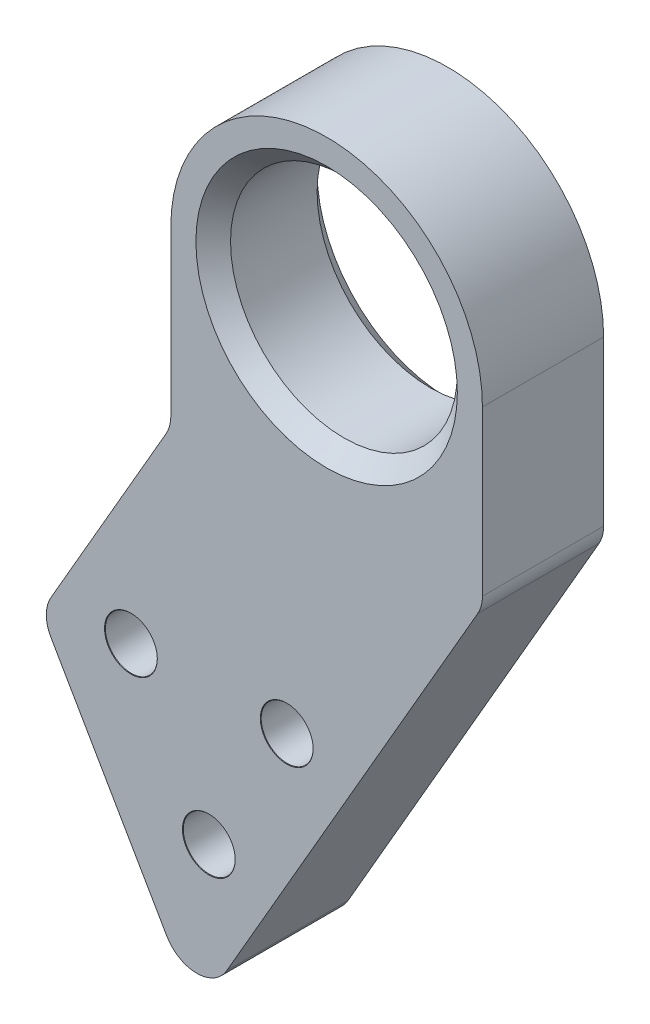
ISO-10303-21;
HEADER;
FILE_DESCRIPTION(('STEP AP214'),'2;1');
FILE_NAME('part.step','',(''),(''),'','','');
FILE_SCHEMA(('AUTOMOTIVE_DESIGN { 1 0 10303 214 1 1 1 1 }'));
ENDSEC;
DATA;
#1=APPLICATION_CONTEXT('core data for automotive mechanical design processes');
#2=APPLICATION_PROTOCOL_DEFINITION('international standard','automotive_design',2000,#1);
#3=PRODUCT_CONTEXT('',#1,'mechanical');
#4=PRODUCT('Part','Part','',(#3));
#5=PRODUCT_RELATED_PRODUCT_CATEGORY('part','',(#4));
#6=PRODUCT_DEFINITION_FORMATION('','',#4);
#7=PRODUCT_DEFINITION_CONTEXT('part definition',#1,'design');
#8=PRODUCT_DEFINITION('design','',#6,#7);
#9=PRODUCT_DEFINITION_SHAPE('','',#8);
#10=(LENGTH_UNIT() NAMED_UNIT(*) SI_UNIT(.MILLI.,.METRE.));
#11=(NAMED_UNIT(*) PLANE_ANGLE_UNIT() SI_UNIT($,.RADIAN.));
#12=(NAMED_UNIT(*) SI_UNIT($,.STERADIAN.) SOLID_ANGLE_UNIT());
#13=UNCERTAINTY_MEASURE_WITH_UNIT(LENGTH_MEASURE(1.E-05),#10,'distance_accuracy_value','');
#14=(GEOMETRIC_REPRESENTATION_CONTEXT(3) GLOBAL_UNCERTAINTY_ASSIGNED_CONTEXT((#13)) GLOBAL_UNIT_ASSIGNED_CONTEXT((#10,
#11,#12)) REPRESENTATION_CONTEXT('',''));
#15=CARTESIAN_POINT('',(0.,0.,0.));
#16=DIRECTION('',(0.,0.,1.));
#17=DIRECTION('',(1.,0.,0.));
#18=AXIS2_PLACEMENT_3D('',#15,#16,#17);
#19=CARTESIAN_POINT('',(0.,0.,7.));
#20=DIRECTION('',(0.,0.,-1.));
#21=DIRECTION('',(-1.,0.,0.));
#22=AXIS2_PLACEMENT_3D('',#19,#20,#21);
#23=PLANE('',#22);
#24=CARTESIAN_POINT('',(-11.3038475772934,-21.9903810567666,7.));
#25=DIRECTION('',(0.,0.,1.));
#26=DIRECTION('',(1.,0.,0.));
#27=AXIS2_PLACEMENT_3D('',#24,#25,#26);
#28=CIRCLE('',#27,1.525);
#29=CARTESIAN_POINT('',(-9.77884757729337,-21.9903810567666,7.));
#30=VERTEX_POINT('',#29);
#31=EDGE_CURVE('E523',#30,#30,#28,.T.);
#32=ORIENTED_EDGE('',*,*,#31,.F.);
#33=EDGE_LOOP('',(#32));
#34=FACE_BOUND('',#33,.T.);
#35=CARTESIAN_POINT('',(-6.80384757729337,-29.7846096908265,7.));
#36=DIRECTION('',(0.,0.,1.));
#37=DIRECTION('',(1.,0.,0.));
#38=AXIS2_PLACEMENT_3D('',#35,#36,#37);
#39=CIRCLE('',#38,1.525);
#40=CARTESIAN_POINT('',(-5.27884757729337,-29.7846096908265,7.));
#41=VERTEX_POINT('',#40);
#42=EDGE_CURVE('E533',#41,#41,#39,.T.);
#43=ORIENTED_EDGE('',*,*,#42,.F.);
#44=EDGE_LOOP('',(#43));
#45=FACE_BOUND('',#44,.T.);
#46=CARTESIAN_POINT('',(-2.30384757729337,-21.9903810567666,7.));
#47=DIRECTION('',(0.,0.,1.));
#48=DIRECTION('',(1.,0.,0.));
#49=AXIS2_PLACEMENT_3D('',#46,#47,#48);
#50=CIRCLE('',#49,1.525);
#51=CARTESIAN_POINT('',(-0.778847577293372,-21.9903810567666,7.));
#52=VERTEX_POINT('',#51);
#53=EDGE_CURVE('E545',#52,#52,#50,.T.);
#54=ORIENTED_EDGE('',*,*,#53,.F.);
#55=EDGE_LOOP('',(#54));
#56=FACE_BOUND('',#55,.T.);
#57=CARTESIAN_POINT('',(0.,0.,7.));
#58=DIRECTION('',(0.,0.,-1.));
#59=DIRECTION('',(-1.,0.,0.));
#60=AXIS2_PLACEMENT_3D('',#57,#58,#59);
#61=CIRCLE('',#60,7.54999999999999);
#62=CARTESIAN_POINT('',(-7.54999999999999,0.,7.));
#63=VERTEX_POINT('',#62);
#64=EDGE_CURVE('E170',#63,#63,#61,.T.);
#65=ORIENTED_EDGE('',*,*,#64,.T.);
#66=EDGE_LOOP('',(#65));
#67=FACE_BOUND('',#66,.T.);
#68=DIRECTION('',(0.500000000000001,0.866025403784438,0.));
#69=VECTOR('',#68,1.);
#70=CARTESIAN_POINT('',(-7.50000000000006,-38.5788383248865,7.));
#71=LINE('',#70,#69);
#72=CARTESIAN_POINT('',(-5.76794919243117,-35.5788383248865,7.));
#73=VERTEX_POINT('',#72);
#74=CARTESIAN_POINT('',(8.73205080756887,-10.4641016151378,7.));
#75=VERTEX_POINT('',#74);
#76=EDGE_CURVE('E237',#73,#75,#71,.T.);
#77=ORIENTED_EDGE('',*,*,#76,.T.);
#78=CARTESIAN_POINT('',(7.,-9.46410161513776,7.));
#79=DIRECTION('',(0.,0.,-1.));
#80=DIRECTION('',(-1.,0.,0.));
#81=AXIS2_PLACEMENT_3D('',#78,#79,#80);
#82=CIRCLE('',#81,2.);
#83=CARTESIAN_POINT('',(9.,-9.46410161513776,7.));
#84=VERTEX_POINT('',#83);
#85=EDGE_CURVE('E208',#75,#84,#82,.F.);
#86=ORIENTED_EDGE('',*,*,#85,.T.);
#87=DIRECTION('',(0.,1.,0.));
#88=VECTOR('',#87,1.);
#89=CARTESIAN_POINT('',(9.,-10.,7.));
#90=LINE('',#89,#88);
#91=CARTESIAN_POINT('',(9.,0.,7.));
#92=VERTEX_POINT('',#91);
#93=EDGE_CURVE('E141',#84,#92,#90,.T.);
#94=ORIENTED_EDGE('',*,*,#93,.T.);
#95=CARTESIAN_POINT('',(0.,0.,7.));
#96=DIRECTION('',(0.,0.,1.));
#97=DIRECTION('',(-1.,0.,0.));
#98=AXIS2_PLACEMENT_3D('',#95,#96,#97);
#99=CIRCLE('',#98,9.);
#100=CARTESIAN_POINT('',(-9.,0.,7.));
#101=VERTEX_POINT('',#100);
#102=EDGE_CURVE('E136',#92,#101,#99,.T.);
#103=ORIENTED_EDGE('',*,*,#102,.T.);
#104=DIRECTION('',(0.,-1.,0.));
#105=VECTOR('',#104,1.);
#106=CARTESIAN_POINT('',(-9.,0.,7.));
#107=LINE('',#106,#105);
#108=CARTESIAN_POINT('',(-9.,-9.46410161513775,7.));
#109=VERTEX_POINT('',#108);
#110=EDGE_CURVE('E124',#101,#109,#107,.T.);
#111=ORIENTED_EDGE('',*,*,#110,.T.);
#112=CARTESIAN_POINT('',(-11.,-9.46410161513775,7.));
#113=DIRECTION('',(0.,0.,-1.));
#114=DIRECTION('',(-1.,0.,0.));
#115=AXIS2_PLACEMENT_3D('',#112,#113,#114);
#116=CIRCLE('',#115,2.);
#117=CARTESIAN_POINT('',(-9.26794919243112,-10.4641016151378,7.));
#118=VERTEX_POINT('',#117);
#119=EDGE_CURVE('E11',#109,#118,#116,.T.);
#120=ORIENTED_EDGE('',*,*,#119,.T.);
#121=DIRECTION('',(-0.500000000000001,-0.866025403784438,0.));
#122=VECTOR('',#121,1.);
#123=CARTESIAN_POINT('',(-9.,-10.,7.));
#124=LINE('',#123,#122);
#125=CARTESIAN_POINT('',(-15.9226497308104,-21.9903810567666,7.));
#126=VERTEX_POINT('',#125);
#127=EDGE_CURVE('E135',#118,#126,#124,.T.);
#128=ORIENTED_EDGE('',*,*,#127,.T.);
#129=CARTESIAN_POINT('',(-14.1905989232415,-22.9903810567666,7.));
#130=DIRECTION('',(0.,0.,-1.));
#131=DIRECTION('',(-1.,0.,0.));
#132=AXIS2_PLACEMENT_3D('',#129,#130,#131);
#133=CIRCLE('',#132,2.);
#134=CARTESIAN_POINT('',(-15.9226497308104,-23.9903810567666,7.));
#135=VERTEX_POINT('',#134);
#136=EDGE_CURVE('E68',#126,#135,#133,.F.);
#137=ORIENTED_EDGE('',*,*,#136,.T.);
#138=DIRECTION('',(0.499999999999998,-0.86602540378444,0.));
#139=VECTOR('',#138,1.);
#140=CARTESIAN_POINT('',(-16.5,-22.9903810567666,7.));
#141=LINE('',#140,#139);
#142=CARTESIAN_POINT('',(-9.23205080756893,-35.5788383248865,7.));
#143=VERTEX_POINT('',#142);
#144=EDGE_CURVE('E234',#135,#143,#141,.T.);
#145=ORIENTED_EDGE('',*,*,#144,.T.);
#146=CARTESIAN_POINT('',(-7.50000000000005,-34.5788383248865,7.));
#147=DIRECTION('',(0.,0.,-1.));
#148=DIRECTION('',(-1.,0.,0.));
#149=AXIS2_PLACEMENT_3D('',#146,#147,#148);
#150=CIRCLE('',#149,2.);
#151=EDGE_CURVE('E205',#143,#73,#150,.F.);
#152=ORIENTED_EDGE('',*,*,#151,.T.);
#153=EDGE_LOOP('',(#77,#86,#94,#103,#111,#120,#128,#137,#145,#152));
#154=FACE_BOUND('',#153,.T.);
#155=ADVANCED_FACE('F45',(#34,#45,#56,#67,#154),#23,.F.);
#156=CARTESIAN_POINT('',(0.,0.,0.));
#157=DIRECTION('',(0.,0.,-1.));
#158=DIRECTION('',(-1.,0.,0.));
#159=AXIS2_PLACEMENT_3D('',#156,#157,#158);
#160=PLANE('',#159);
#161=CARTESIAN_POINT('',(-11.3038475772934,-21.9903810567666,0.));
#162=DIRECTION('',(0.,0.,1.));
#163=DIRECTION('',(1.,0.,0.));
#164=AXIS2_PLACEMENT_3D('',#161,#162,#163);
#165=CIRCLE('',#164,1.5);
#166=CARTESIAN_POINT('',(-9.80384757729337,-21.9903810567666,0.));
#167=VERTEX_POINT('',#166);
#168=EDGE_CURVE('E527',#167,#167,#165,.T.);
#169=ORIENTED_EDGE('',*,*,#168,.T.);
#170=EDGE_LOOP('',(#169));
#171=FACE_BOUND('',#170,.T.);
#172=CARTESIAN_POINT('',(-6.80384757729337,-29.7846096908265,0.));
#173=DIRECTION('',(0.,0.,1.));
#174=DIRECTION('',(1.,0.,0.));
#175=AXIS2_PLACEMENT_3D('',#172,#173,#174);
#176=CIRCLE('',#175,1.5);
#177=CARTESIAN_POINT('',(-5.30384757729337,-29.7846096908265,0.));
#178=VERTEX_POINT('',#177);
#179=EDGE_CURVE('E541',#178,#178,#176,.T.);
#180=ORIENTED_EDGE('',*,*,#179,.T.);
#181=EDGE_LOOP('',(#180));
#182=FACE_BOUND('',#181,.T.);
#183=CARTESIAN_POINT('',(-2.30384757729337,-21.9903810567666,0.));
#184=DIRECTION('',(0.,0.,1.));
#185=DIRECTION('',(1.,0.,0.));
#186=AXIS2_PLACEMENT_3D('',#183,#184,#185);
#187=CIRCLE('',#186,1.5);
#188=CARTESIAN_POINT('',(-0.803847577293372,-21.9903810567666,0.));
#189=VERTEX_POINT('',#188);
#190=EDGE_CURVE('E245',#189,#189,#187,.T.);
#191=ORIENTED_EDGE('',*,*,#190,.T.);
#192=EDGE_LOOP('',(#191));
#193=FACE_BOUND('',#192,.T.);
#194=CARTESIAN_POINT('',(0.,0.,0.));
#195=DIRECTION('',(0.,0.,-1.));
#196=DIRECTION('',(-1.,0.,0.));
#197=AXIS2_PLACEMENT_3D('',#194,#195,#196);
#198=CIRCLE('',#197,7.55);
#199=CARTESIAN_POINT('',(-7.55,0.,0.));
#200=VERTEX_POINT('',#199);
#201=EDGE_CURVE('E152',#200,#200,#198,.F.);
#202=ORIENTED_EDGE('',*,*,#201,.T.);
#203=EDGE_LOOP('',(#202));
#204=FACE_BOUND('',#203,.T.);
#205=DIRECTION('',(0.,1.,0.));
#206=VECTOR('',#205,1.);
#207=CARTESIAN_POINT('',(9.,-10.,0.));
#208=LINE('',#207,#206);
#209=CARTESIAN_POINT('',(9.,-9.46410161513776,0.));
#210=VERTEX_POINT('',#209);
#211=CARTESIAN_POINT('',(9.,0.,0.));
#212=VERTEX_POINT('',#211);
#213=EDGE_CURVE('E146',#210,#212,#208,.T.);
#214=ORIENTED_EDGE('',*,*,#213,.F.);
#215=CARTESIAN_POINT('',(7.,-9.46410161513776,0.));
#216=DIRECTION('',(0.,0.,-1.));
#217=DIRECTION('',(-1.,0.,0.));
#218=AXIS2_PLACEMENT_3D('',#215,#216,#217);
#219=CIRCLE('',#218,2.);
#220=CARTESIAN_POINT('',(8.73205080756887,-10.4641016151378,0.));
#221=VERTEX_POINT('',#220);
#222=EDGE_CURVE('E193',#210,#221,#219,.T.);
#223=ORIENTED_EDGE('',*,*,#222,.T.);
#224=DIRECTION('',(0.500000000000001,0.866025403784438,0.));
#225=VECTOR('',#224,1.);
#226=CARTESIAN_POINT('',(-7.50000000000006,-38.5788383248865,0.));
#227=LINE('',#226,#225);
#228=CARTESIAN_POINT('',(-5.76794919243117,-35.5788383248865,0.));
#229=VERTEX_POINT('',#228);
#230=EDGE_CURVE('E252',#229,#221,#227,.T.);
#231=ORIENTED_EDGE('',*,*,#230,.F.);
#232=CARTESIAN_POINT('',(-7.50000000000005,-34.5788383248865,0.));
#233=DIRECTION('',(0.,0.,-1.));
#234=DIRECTION('',(-1.,0.,0.));
#235=AXIS2_PLACEMENT_3D('',#232,#233,#234);
#236=CIRCLE('',#235,2.);
#237=CARTESIAN_POINT('',(-9.23205080756893,-35.5788383248865,0.));
#238=VERTEX_POINT('',#237);
#239=EDGE_CURVE('E190',#229,#238,#236,.T.);
#240=ORIENTED_EDGE('',*,*,#239,.T.);
#241=DIRECTION('',(0.499999999999998,-0.86602540378444,0.));
#242=VECTOR('',#241,1.);
#243=CARTESIAN_POINT('',(-16.5,-22.9903810567666,0.));
#244=LINE('',#243,#242);
#245=CARTESIAN_POINT('',(-15.9226497308104,-23.9903810567666,0.));
#246=VERTEX_POINT('',#245);
#247=EDGE_CURVE('E249',#246,#238,#244,.T.);
#248=ORIENTED_EDGE('',*,*,#247,.F.);
#249=CARTESIAN_POINT('',(-14.1905989232415,-22.9903810567666,0.));
#250=DIRECTION('',(0.,0.,-1.));
#251=DIRECTION('',(-1.,0.,0.));
#252=AXIS2_PLACEMENT_3D('',#249,#250,#251);
#253=CIRCLE('',#252,2.);
#254=CARTESIAN_POINT('',(-15.9226497308104,-21.9903810567666,0.));
#255=VERTEX_POINT('',#254);
#256=EDGE_CURVE('E187',#246,#255,#253,.T.);
#257=ORIENTED_EDGE('',*,*,#256,.T.);
#258=DIRECTION('',(-0.500000000000001,-0.866025403784438,0.));
#259=VECTOR('',#258,1.);
#260=CARTESIAN_POINT('',(-9.,-10.,0.));
#261=LINE('',#260,#259);
#262=CARTESIAN_POINT('',(-9.26794919243112,-10.4641016151378,0.));
#263=VERTEX_POINT('',#262);
#264=EDGE_CURVE('E223',#263,#255,#261,.T.);
#265=ORIENTED_EDGE('',*,*,#264,.F.);
#266=CARTESIAN_POINT('',(-11.,-9.46410161513775,0.));
#267=DIRECTION('',(0.,0.,-1.));
#268=DIRECTION('',(-1.,0.,0.));
#269=AXIS2_PLACEMENT_3D('',#266,#267,#268);
#270=CIRCLE('',#269,2.);
#271=CARTESIAN_POINT('',(-9.,-9.46410161513775,0.));
#272=VERTEX_POINT('',#271);
#273=EDGE_CURVE('E54',#263,#272,#270,.F.);
#274=ORIENTED_EDGE('',*,*,#273,.T.);
#275=DIRECTION('',(0.,-1.,0.));
#276=VECTOR('',#275,1.);
#277=CARTESIAN_POINT('',(-9.,0.,0.));
#278=LINE('',#277,#276);
#279=CARTESIAN_POINT('',(-9.,0.,0.));
#280=VERTEX_POINT('',#279);
#281=EDGE_CURVE('E221',#280,#272,#278,.T.);
#282=ORIENTED_EDGE('',*,*,#281,.F.);
#283=CARTESIAN_POINT('',(0.,0.,0.));
#284=DIRECTION('',(0.,0.,1.));
#285=DIRECTION('',(-1.,0.,0.));
#286=AXIS2_PLACEMENT_3D('',#283,#284,#285);
#287=CIRCLE('',#286,9.);
#288=EDGE_CURVE('E150',#212,#280,#287,.T.);
#289=ORIENTED_EDGE('',*,*,#288,.F.);
#290=EDGE_LOOP('',(#214,#223,#231,#240,#248,#257,#265,#274,#282,#289));
#291=FACE_BOUND('',#290,.T.);
#292=ADVANCED_FACE('F220',(#171,#182,#193,#204,#291),#160,.T.);
#293=CARTESIAN_POINT('',(0.,0.,7.));
#294=DIRECTION('',(0.,0.,-1.));
#295=DIRECTION('',(-1.,0.,0.));
#296=AXIS2_PLACEMENT_3D('',#293,#294,#295);
#297=CYLINDRICAL_SURFACE('',#296,9.);
#298=ORIENTED_EDGE('',*,*,#288,.T.);
#299=DIRECTION('',(0.,0.,-1.));
#300=VECTOR('',#299,1.);
#301=CARTESIAN_POINT('',(-9.,0.,7.));
#302=LINE('',#301,#300);
#303=EDGE_CURVE('E129',#101,#280,#302,.T.);
#304=ORIENTED_EDGE('',*,*,#303,.F.);
#305=ORIENTED_EDGE('',*,*,#102,.F.);
#306=DIRECTION('',(0.,0.,-1.));
#307=VECTOR('',#306,1.);
#308=CARTESIAN_POINT('',(9.,0.,7.));
#309=LINE('',#308,#307);
#310=EDGE_CURVE('E153',#92,#212,#309,.T.);
#311=ORIENTED_EDGE('',*,*,#310,.T.);
#312=EDGE_LOOP('',(#298,#304,#305,#311));
#313=FACE_BOUND('',#312,.T.);
#314=ADVANCED_FACE('F148',(#313),#297,.T.);
#315=CARTESIAN_POINT('',(-9.,0.,7.));
#316=DIRECTION('',(1.,0.,0.));
#317=DIRECTION('',(0.,1.,0.));
#318=AXIS2_PLACEMENT_3D('',#315,#316,#317);
#319=PLANE('',#318);
#320=ORIENTED_EDGE('',*,*,#281,.T.);
#321=DIRECTION('',(0.,0.,-1.));
#322=VECTOR('',#321,1.);
#323=CARTESIAN_POINT('',(-9.,-9.46410161513775,7.));
#324=LINE('',#323,#322);
#325=EDGE_CURVE('E132',#272,#109,#324,.F.);
#326=ORIENTED_EDGE('',*,*,#325,.T.);
#327=ORIENTED_EDGE('',*,*,#110,.F.);
#328=ORIENTED_EDGE('',*,*,#303,.T.);
#329=EDGE_LOOP('',(#320,#326,#327,#328));
#330=FACE_BOUND('',#329,.T.);
#331=ADVANCED_FACE('F127',(#330),#319,.F.);
#332=CARTESIAN_POINT('',(-9.,-10.,7.));
#333=DIRECTION('',(0.866025403784438,-0.500000000000001,0.));
#334=DIRECTION('',(0.500000000000001,0.866025403784438,0.));
#335=AXIS2_PLACEMENT_3D('',#332,#333,#334);
#336=PLANE('',#335);
#337=ORIENTED_EDGE('',*,*,#127,.F.);
#338=DIRECTION('',(0.,0.,-1.));
#339=VECTOR('',#338,1.);
#340=CARTESIAN_POINT('',(-9.26794919243112,-10.4641016151378,0.));
#341=LINE('',#340,#339);
#342=EDGE_CURVE('E177',#118,#263,#341,.T.);
#343=ORIENTED_EDGE('',*,*,#342,.T.);
#344=ORIENTED_EDGE('',*,*,#264,.T.);
#345=DIRECTION('',(0.,0.,-1.));
#346=VECTOR('',#345,1.);
#347=CARTESIAN_POINT('',(-15.9226497308104,-21.9903810567666,7.));
#348=LINE('',#347,#346);
#349=EDGE_CURVE('E174',#255,#126,#348,.F.);
#350=ORIENTED_EDGE('',*,*,#349,.T.);
#351=EDGE_LOOP('',(#337,#343,#344,#350));
#352=FACE_BOUND('',#351,.T.);
#353=ADVANCED_FACE('F231',(#352),#336,.F.);
#354=CARTESIAN_POINT('',(-16.5,-22.9903810567666,7.));
#355=DIRECTION('',(0.86602540378444,0.499999999999998,0.));
#356=DIRECTION('',(-0.499999999999998,0.86602540378444,0.));
#357=AXIS2_PLACEMENT_3D('',#354,#355,#356);
#358=PLANE('',#357);
#359=ORIENTED_EDGE('',*,*,#247,.T.);
#360=DIRECTION('',(0.,0.,-1.));
#361=VECTOR('',#360,1.);
#362=CARTESIAN_POINT('',(-9.23205080756893,-35.5788383248865,7.));
#363=LINE('',#362,#361);
#364=EDGE_CURVE('E61',#238,#143,#363,.F.);
#365=ORIENTED_EDGE('',*,*,#364,.T.);
#366=ORIENTED_EDGE('',*,*,#144,.F.);
#367=DIRECTION('',(0.,0.,-1.));
#368=VECTOR('',#367,1.);
#369=CARTESIAN_POINT('',(-15.9226497308104,-23.9903810567666,7.));
#370=LINE('',#369,#368);
#371=EDGE_CURVE('E211',#135,#246,#370,.T.);
#372=ORIENTED_EDGE('',*,*,#371,.T.);
#373=EDGE_LOOP('',(#359,#365,#366,#372));
#374=FACE_BOUND('',#373,.T.);
#375=ADVANCED_FACE('F272',(#374),#358,.F.);
#376=CARTESIAN_POINT('',(-7.50000000000006,-38.5788383248865,7.));
#377=DIRECTION('',(-0.866025403784438,0.500000000000001,0.));
#378=DIRECTION('',(-0.500000000000001,-0.866025403784438,0.));
#379=AXIS2_PLACEMENT_3D('',#376,#377,#378);
#380=PLANE('',#379);
#381=ORIENTED_EDGE('',*,*,#230,.T.);
#382=DIRECTION('',(0.,0.,-1.));
#383=VECTOR('',#382,1.);
#384=CARTESIAN_POINT('',(8.73205080756887,-10.4641016151378,7.));
#385=LINE('',#384,#383);
#386=EDGE_CURVE('E200',#221,#75,#385,.F.);
#387=ORIENTED_EDGE('',*,*,#386,.T.);
#388=ORIENTED_EDGE('',*,*,#76,.F.);
#389=DIRECTION('',(0.,0.,-1.));
#390=VECTOR('',#389,1.);
#391=CARTESIAN_POINT('',(-5.76794919243117,-35.5788383248865,7.));
#392=LINE('',#391,#390);
#393=EDGE_CURVE('E196',#73,#229,#392,.T.);
#394=ORIENTED_EDGE('',*,*,#393,.T.);
#395=EDGE_LOOP('',(#381,#387,#388,#394));
#396=FACE_BOUND('',#395,.T.);
#397=ADVANCED_FACE('F263',(#396),#380,.F.);
#398=CARTESIAN_POINT('',(9.,-10.,7.));
#399=DIRECTION('',(-1.,0.,0.));
#400=DIRECTION('',(0.,0.,1.));
#401=AXIS2_PLACEMENT_3D('',#398,#399,#400);
#402=PLANE('',#401);
#403=ORIENTED_EDGE('',*,*,#93,.F.);
#404=DIRECTION('',(0.,0.,-1.));
#405=VECTOR('',#404,1.);
#406=CARTESIAN_POINT('',(9.,-9.46410161513776,7.));
#407=LINE('',#406,#405);
#408=EDGE_CURVE('E183',#84,#210,#407,.T.);
#409=ORIENTED_EDGE('',*,*,#408,.T.);
#410=ORIENTED_EDGE('',*,*,#213,.T.);
#411=ORIENTED_EDGE('',*,*,#310,.F.);
#412=EDGE_LOOP('',(#403,#409,#410,#411));
#413=FACE_BOUND('',#412,.T.);
#414=ADVANCED_FACE('F257',(#413),#402,.F.);
#415=CARTESIAN_POINT('',(0.,0.,7.));
#416=DIRECTION('',(0.,0.,-1.));
#417=DIRECTION('',(-1.,0.,0.));
#418=AXIS2_PLACEMENT_3D('',#415,#416,#417);
#419=CYLINDRICAL_SURFACE('',#418,6.55);
#420=CARTESIAN_POINT('',(0.,0.,0.999999999999994));
#421=DIRECTION('',(0.,0.,-1.));
#422=DIRECTION('',(-1.,0.,0.));
#423=AXIS2_PLACEMENT_3D('',#420,#421,#422);
#424=CIRCLE('',#423,6.55);
#425=CARTESIAN_POINT('',(-6.55,0.,0.999999999999994));
#426=VERTEX_POINT('',#425);
#427=EDGE_CURVE('E166',#426,#426,#424,.T.);
#428=ORIENTED_EDGE('',*,*,#427,.T.);
#429=EDGE_LOOP('',(#428));
#430=FACE_BOUND('',#429,.T.);
#431=CARTESIAN_POINT('',(0.,0.,6.00000000000001));
#432=DIRECTION('',(0.,0.,-1.));
#433=DIRECTION('',(-1.,0.,0.));
#434=AXIS2_PLACEMENT_3D('',#431,#432,#433);
#435=CIRCLE('',#434,6.55);
#436=CARTESIAN_POINT('',(-6.55,0.,6.00000000000001));
#437=VERTEX_POINT('',#436);
#438=EDGE_CURVE('E158',#437,#437,#435,.F.);
#439=ORIENTED_EDGE('',*,*,#438,.T.);
#440=EDGE_LOOP('',(#439));
#441=FACE_BOUND('',#440,.T.);
#442=ADVANCED_FACE('F295',(#430,#441),#419,.F.);
#443=CARTESIAN_POINT('',(0.,0.,0.));
#444=DIRECTION('',(0.,0.,-1.));
#445=DIRECTION('',(-1.,0.,0.));
#446=AXIS2_PLACEMENT_3D('',#443,#444,#445);
#447=CONICAL_SURFACE('',#446,7.55,0.78539816339745);
#448=ORIENTED_EDGE('',*,*,#427,.F.);
#449=EDGE_LOOP('',(#448));
#450=FACE_BOUND('',#449,.T.);
#451=ORIENTED_EDGE('',*,*,#201,.F.);
#452=EDGE_LOOP('',(#451));
#453=FACE_BOUND('',#452,.T.);
#454=ADVANCED_FACE('F310',(#450,#453),#447,.F.);
#455=CARTESIAN_POINT('',(0.,0.,6.00000000000001));
#456=DIRECTION('',(0.,0.,1.));
#457=DIRECTION('',(1.,0.,0.));
#458=AXIS2_PLACEMENT_3D('',#455,#456,#457);
#459=CONICAL_SURFACE('',#458,6.55,0.785398163397451);
#460=ORIENTED_EDGE('',*,*,#64,.F.);
#461=EDGE_LOOP('',(#460));
#462=FACE_BOUND('',#461,.T.);
#463=ORIENTED_EDGE('',*,*,#438,.F.);
#464=EDGE_LOOP('',(#463));
#465=FACE_BOUND('',#464,.T.);
#466=ADVANCED_FACE('F316',(#462,#465),#459,.F.);
#467=CARTESIAN_POINT('',(-11.,-9.46410161513775,7.));
#468=DIRECTION('',(0.,0.,1.));
#469=DIRECTION('',(1.,0.,0.));
#470=AXIS2_PLACEMENT_3D('',#467,#468,#469);
#471=CYLINDRICAL_SURFACE('',#470,2.);
#472=ORIENTED_EDGE('',*,*,#119,.F.);
#473=ORIENTED_EDGE('',*,*,#325,.F.);
#474=ORIENTED_EDGE('',*,*,#273,.F.);
#475=ORIENTED_EDGE('',*,*,#342,.F.);
#476=EDGE_LOOP('',(#472,#473,#474,#475));
#477=FACE_BOUND('',#476,.T.);
#478=ADVANCED_FACE('F228',(#477),#471,.F.);
#479=CARTESIAN_POINT('',(7.,-9.46410161513776,7.));
#480=DIRECTION('',(0.,0.,-1.));
#481=DIRECTION('',(-1.,0.,0.));
#482=AXIS2_PLACEMENT_3D('',#479,#480,#481);
#483=CYLINDRICAL_SURFACE('',#482,2.);
#484=ORIENTED_EDGE('',*,*,#85,.F.);
#485=ORIENTED_EDGE('',*,*,#386,.F.);
#486=ORIENTED_EDGE('',*,*,#222,.F.);
#487=ORIENTED_EDGE('',*,*,#408,.F.);
#488=EDGE_LOOP('',(#484,#485,#486,#487));
#489=FACE_BOUND('',#488,.T.);
#490=ADVANCED_FACE('F267',(#489),#483,.T.);
#491=CARTESIAN_POINT('',(-7.50000000000005,-34.5788383248865,7.));
#492=DIRECTION('',(0.,0.,-1.));
#493=DIRECTION('',(-1.,0.,0.));
#494=AXIS2_PLACEMENT_3D('',#491,#492,#493);
#495=CYLINDRICAL_SURFACE('',#494,2.);
#496=ORIENTED_EDGE('',*,*,#151,.F.);
#497=ORIENTED_EDGE('',*,*,#364,.F.);
#498=ORIENTED_EDGE('',*,*,#239,.F.);
#499=ORIENTED_EDGE('',*,*,#393,.F.);
#500=EDGE_LOOP('',(#496,#497,#498,#499));
#501=FACE_BOUND('',#500,.T.);
#502=ADVANCED_FACE('F270',(#501),#495,.T.);
#503=CARTESIAN_POINT('',(-14.1905989232415,-22.9903810567666,7.));
#504=DIRECTION('',(0.,0.,-1.));
#505=DIRECTION('',(-1.,0.,0.));
#506=AXIS2_PLACEMENT_3D('',#503,#504,#505);
#507=CYLINDRICAL_SURFACE('',#506,2.);
#508=ORIENTED_EDGE('',*,*,#136,.F.);
#509=ORIENTED_EDGE('',*,*,#349,.F.);
#510=ORIENTED_EDGE('',*,*,#256,.F.);
#511=ORIENTED_EDGE('',*,*,#371,.F.);
#512=EDGE_LOOP('',(#508,#509,#510,#511));
#513=FACE_BOUND('',#512,.T.);
#514=ADVANCED_FACE('F47',(#513),#507,.T.);
#515=CARTESIAN_POINT('',(-2.30384757729337,-21.9903810567666,7.));
#516=DIRECTION('',(0.,0.,1.));
#517=DIRECTION('',(1.,0.,0.));
#518=AXIS2_PLACEMENT_3D('',#515,#516,#517);
#519=CYLINDRICAL_SURFACE('',#518,1.5);
#520=ORIENTED_EDGE('',*,*,#190,.F.);
#521=EDGE_LOOP('',(#520));
#522=FACE_BOUND('',#521,.T.);
#523=CARTESIAN_POINT('',(-2.30384757729337,-21.9903810567666,6.975));
#524=DIRECTION('',(0.,0.,1.));
#525=DIRECTION('',(1.,0.,0.));
#526=AXIS2_PLACEMENT_3D('',#523,#524,#525);
#527=CIRCLE('',#526,1.5);
#528=CARTESIAN_POINT('',(-0.803847577293371,-21.9903810567666,6.975));
#529=VERTEX_POINT('',#528);
#530=EDGE_CURVE('E549',#529,#529,#527,.T.);
#531=ORIENTED_EDGE('',*,*,#530,.T.);
#532=EDGE_LOOP('',(#531));
#533=FACE_BOUND('',#532,.T.);
#534=ADVANCED_FACE('F276',(#522,#533),#519,.F.);
#535=CARTESIAN_POINT('',(-2.30384757729337,-21.9903810567666,7.));
#536=DIRECTION('',(0.,0.,1.));
#537=DIRECTION('',(1.,0.,0.));
#538=AXIS2_PLACEMENT_3D('',#535,#536,#537);
#539=CONICAL_SURFACE('',#538,1.525,0.785398163397448);
#540=ORIENTED_EDGE('',*,*,#530,.F.);
#541=EDGE_LOOP('',(#540));
#542=FACE_BOUND('',#541,.T.);
#543=ORIENTED_EDGE('',*,*,#53,.T.);
#544=EDGE_LOOP('',(#543));
#545=FACE_BOUND('',#544,.T.);
#546=ADVANCED_FACE('F281',(#542,#545),#539,.F.);
#547=CARTESIAN_POINT('',(-6.80384757729337,-29.7846096908265,7.));
#548=DIRECTION('',(0.,0.,1.));
#549=DIRECTION('',(1.,0.,0.));
#550=AXIS2_PLACEMENT_3D('',#547,#548,#549);
#551=CYLINDRICAL_SURFACE('',#550,1.5);
#552=ORIENTED_EDGE('',*,*,#179,.F.);
#553=EDGE_LOOP('',(#552));
#554=FACE_BOUND('',#553,.T.);
#555=CARTESIAN_POINT('',(-6.80384757729337,-29.7846096908265,6.975));
#556=DIRECTION('',(0.,0.,1.));
#557=DIRECTION('',(1.,0.,0.));
#558=AXIS2_PLACEMENT_3D('',#555,#556,#557);
#559=CIRCLE('',#558,1.5);
#560=CARTESIAN_POINT('',(-5.30384757729337,-29.7846096908265,6.975));
#561=VERTEX_POINT('',#560);
#562=EDGE_CURVE('E537',#561,#561,#559,.T.);
#563=ORIENTED_EDGE('',*,*,#562,.T.);
#564=EDGE_LOOP('',(#563));
#565=FACE_BOUND('',#564,.T.);
#566=ADVANCED_FACE('F369',(#554,#565),#551,.F.);
#567=CARTESIAN_POINT('',(-6.80384757729337,-29.7846096908265,7.));
#568=DIRECTION('',(0.,0.,1.));
#569=DIRECTION('',(1.,0.,0.));
#570=AXIS2_PLACEMENT_3D('',#567,#568,#569);
#571=CONICAL_SURFACE('',#570,1.525,0.785398163397466);
#572=ORIENTED_EDGE('',*,*,#562,.F.);
#573=EDGE_LOOP('',(#572));
#574=FACE_BOUND('',#573,.T.);
#575=ORIENTED_EDGE('',*,*,#42,.T.);
#576=EDGE_LOOP('',(#575));
#577=FACE_BOUND('',#576,.T.);
#578=ADVANCED_FACE('F380',(#574,#577),#571,.F.);
#579=CARTESIAN_POINT('',(-11.3038475772934,-21.9903810567666,7.));
#580=DIRECTION('',(0.,0.,1.));
#581=DIRECTION('',(1.,0.,0.));
#582=AXIS2_PLACEMENT_3D('',#579,#580,#581);
#583=CYLINDRICAL_SURFACE('',#582,1.5);
#584=ORIENTED_EDGE('',*,*,#168,.F.);
#585=EDGE_LOOP('',(#584));
#586=FACE_BOUND('',#585,.T.);
#587=CARTESIAN_POINT('',(-11.3038475772934,-21.9903810567666,6.975));
#588=DIRECTION('',(0.,0.,1.));
#589=DIRECTION('',(1.,0.,0.));
#590=AXIS2_PLACEMENT_3D('',#587,#588,#589);
#591=CIRCLE('',#590,1.5);
#592=CARTESIAN_POINT('',(-9.80384757729337,-21.9903810567666,6.975));
#593=VERTEX_POINT('',#592);
#594=EDGE_CURVE('E521',#593,#593,#591,.T.);
#595=ORIENTED_EDGE('',*,*,#594,.T.);
#596=EDGE_LOOP('',(#595));
#597=FACE_BOUND('',#596,.T.);
#598=ADVANCED_FACE('F391',(#586,#597),#583,.F.);
#599=CARTESIAN_POINT('',(-11.3038475772934,-21.9903810567666,7.));
#600=DIRECTION('',(0.,0.,1.));
#601=DIRECTION('',(1.,0.,0.));
#602=AXIS2_PLACEMENT_3D('',#599,#600,#601);
#603=CONICAL_SURFACE('',#602,1.525,0.785398163397466);
#604=ORIENTED_EDGE('',*,*,#594,.F.);
#605=EDGE_LOOP('',(#604));
#606=FACE_BOUND('',#605,.T.);
#607=ORIENTED_EDGE('',*,*,#31,.T.);
#608=EDGE_LOOP('',(#607));
#609=FACE_BOUND('',#608,.T.);
#610=ADVANCED_FACE('F402',(#606,#609),#603,.F.);
#611=CLOSED_SHELL('',(#155,#292,#314,#331,#353,#375,#397,#414,#442,#454,#466,#478,#490,#502,
#514,#534,#546,#566,#578,#598,#610));
#612=MANIFOLD_SOLID_BREP('B2',#611);
#613=ADVANCED_BREP_SHAPE_REPRESENTATION('',(#18,#612),#14);
#614=SHAPE_DEFINITION_REPRESENTATION(#9,#613);
ENDSEC;
END-ISO-10303-21;
